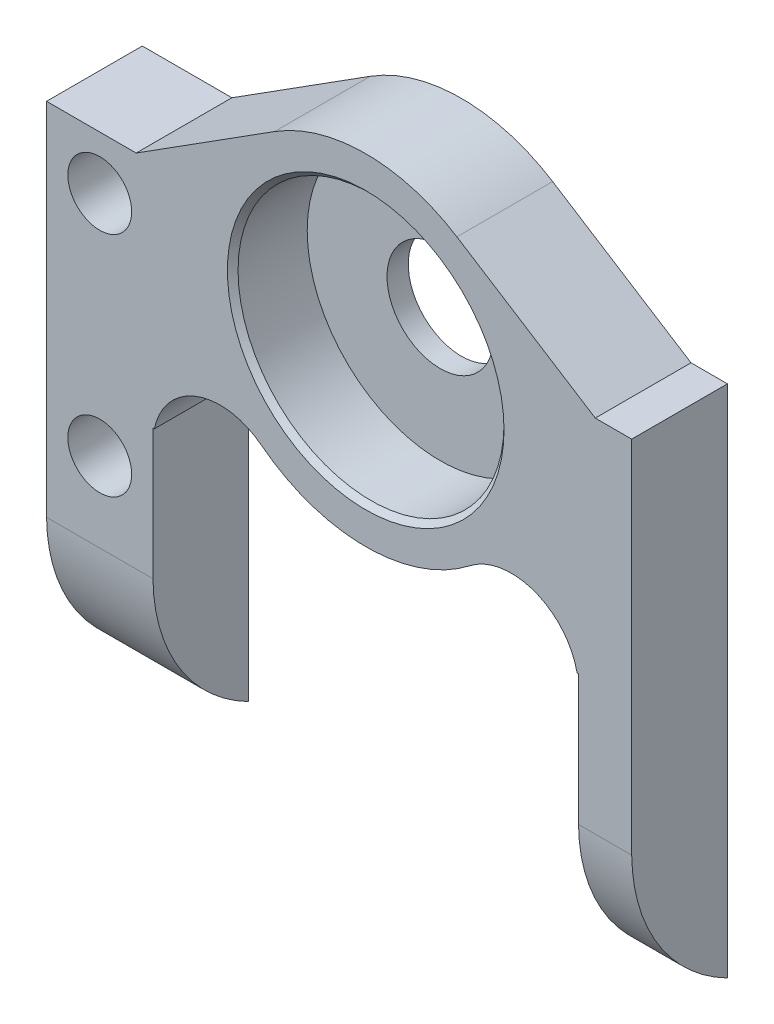
ISO-10303-21;
HEADER;
FILE_DESCRIPTION(('STEP AP214'),'2;1');
FILE_NAME('part.step','',(''),(''),'','','');
FILE_SCHEMA(('AUTOMOTIVE_DESIGN { 1 0 10303 214 1 1 1 1 }'));
ENDSEC;
DATA;
#1=APPLICATION_CONTEXT('core data for automotive mechanical design processes');
#2=APPLICATION_PROTOCOL_DEFINITION('international standard','automotive_design',2000,#1);
#3=PRODUCT_CONTEXT('',#1,'mechanical');
#4=PRODUCT('Part','Part','',(#3));
#5=PRODUCT_RELATED_PRODUCT_CATEGORY('part','',(#4));
#6=PRODUCT_DEFINITION_FORMATION('','',#4);
#7=PRODUCT_DEFINITION_CONTEXT('part definition',#1,'design');
#8=PRODUCT_DEFINITION('design','',#6,#7);
#9=PRODUCT_DEFINITION_SHAPE('','',#8);
#10=(LENGTH_UNIT() NAMED_UNIT(*) SI_UNIT(.MILLI.,.METRE.));
#11=(NAMED_UNIT(*) PLANE_ANGLE_UNIT() SI_UNIT($,.RADIAN.));
#12=(NAMED_UNIT(*) SI_UNIT($,.STERADIAN.) SOLID_ANGLE_UNIT());
#13=UNCERTAINTY_MEASURE_WITH_UNIT(LENGTH_MEASURE(1.E-05),#10,'distance_accuracy_value','');
#14=(GEOMETRIC_REPRESENTATION_CONTEXT(3) GLOBAL_UNCERTAINTY_ASSIGNED_CONTEXT((#13)) GLOBAL_UNIT_ASSIGNED_CONTEXT((#10,
#11,#12)) REPRESENTATION_CONTEXT('',''));
#15=CARTESIAN_POINT('',(0.,0.,0.));
#16=DIRECTION('',(0.,0.,1.));
#17=DIRECTION('',(1.,0.,0.));
#18=AXIS2_PLACEMENT_3D('',#15,#16,#17);
#19=CARTESIAN_POINT('',(20.4539793715245,36.3079461033165,38.4919127822395));
#20=DIRECTION('',(0.,-1.,0.));
#21=DIRECTION('',(0.,0.,-1.));
#22=AXIS2_PLACEMENT_3D('',#19,#20,#21);
#23=PLANE('',#22);
#24=DIRECTION('',(-1.,0.,0.));
#25=VECTOR('',#24,1.);
#26=CARTESIAN_POINT('',(19.6660837446074,36.3079461033165,58.9779248072098));
#27=LINE('',#26,#25);
#28=CARTESIAN_POINT('',(18.9539793715244,36.3079461033165,58.9779248072098));
#29=VERTEX_POINT('',#28);
#30=CARTESIAN_POINT('',(17.2418749984415,36.3079461033165,58.9779248072098));
#31=VERTEX_POINT('',#30);
#32=EDGE_CURVE('E58',#29,#31,#27,.T.);
#33=ORIENTED_EDGE('',*,*,#32,.F.);
#34=DIRECTION('',(0.,0.,1.));
#35=VECTOR('',#34,1.);
#36=CARTESIAN_POINT('',(18.9539793715244,36.3079461033165,58.9779248072098));
#37=LINE('',#36,#35);
#38=CARTESIAN_POINT('',(18.9539793715244,36.3079461033165,54.4779248072098));
#39=VERTEX_POINT('',#38);
#40=EDGE_CURVE('E174',#39,#29,#37,.T.);
#41=ORIENTED_EDGE('',*,*,#40,.F.);
#42=DIRECTION('',(-1.,0.,0.));
#43=VECTOR('',#42,1.);
#44=CARTESIAN_POINT('',(20.4539793715245,36.3079461033165,54.4779248072098));
#45=LINE('',#44,#43);
#46=CARTESIAN_POINT('',(17.2418749984415,36.3079461033165,54.4779248072098));
#47=VERTEX_POINT('',#46);
#48=EDGE_CURVE('E205',#39,#47,#45,.T.);
#49=ORIENTED_EDGE('',*,*,#48,.T.);
#50=DIRECTION('',(0.,0.,1.));
#51=VECTOR('',#50,1.);
#52=CARTESIAN_POINT('',(17.2418749984415,36.3079461033164,48.713060951552));
#53=LINE('',#52,#51);
#54=EDGE_CURVE('E235',#47,#31,#53,.T.);
#55=ORIENTED_EDGE('',*,*,#54,.T.);
#56=EDGE_LOOP('',(#33,#41,#49,#55));
#57=FACE_BOUND('',#56,.T.);
#58=ADVANCED_FACE('F35',(#57),#23,.F.);
#59=CARTESIAN_POINT('',(16.4539793715245,26.9126796587266,47.2821640348694));
#60=DIRECTION('',(1.,0.,0.));
#61=DIRECTION('',(0.,1.,0.));
#62=AXIS2_PLACEMENT_3D('',#59,#60,#61);
#63=PLANE('',#62);
#64=DIRECTION('',(0.,1.,0.));
#65=VECTOR('',#64,1.);
#66=CARTESIAN_POINT('',(16.4539793715245,31.8046400649043,54.4779248072098));
#67=LINE('',#66,#65);
#68=CARTESIAN_POINT('',(16.4539793715245,12.1248421508215,54.4779248072098));
#69=VERTEX_POINT('',#68);
#70=CARTESIAN_POINT('',(16.4539793715245,25.509515316423,54.4779248072098));
#71=VERTEX_POINT('',#70);
#72=EDGE_CURVE('E212',#69,#71,#67,.T.);
#73=ORIENTED_EDGE('',*,*,#72,.F.);
#74=CARTESIAN_POINT('',(16.4539793715245,19.4736130832342,50.7285160827672));
#75=DIRECTION('',(1.,0.,0.));
#76=DIRECTION('',(0.,0.,-1.));
#77=AXIS2_PLACEMENT_3D('',#74,#75,#76);
#78=CIRCLE('',#77,8.25);
#79=CARTESIAN_POINT('',(16.4539793715245,19.3748421508215,58.9779248072098));
#80=VERTEX_POINT('',#79);
#81=EDGE_CURVE('E176',#69,#80,#78,.F.);
#82=ORIENTED_EDGE('',*,*,#81,.T.);
#83=DIRECTION('',(0.,1.,0.));
#84=VECTOR('',#83,1.);
#85=CARTESIAN_POINT('',(16.4539793715245,33.6779461033165,58.9779248072098));
#86=LINE('',#85,#84);
#87=CARTESIAN_POINT('',(16.4539793715245,25.509515316423,58.9779248072098));
#88=VERTEX_POINT('',#87);
#89=EDGE_CURVE('E168',#80,#88,#86,.T.);
#90=ORIENTED_EDGE('',*,*,#89,.T.);
#91=DIRECTION('',(0.,0.,1.));
#92=VECTOR('',#91,1.);
#93=CARTESIAN_POINT('',(16.4539793715245,25.509515316423,38.021715158118));
#94=LINE('',#93,#92);
#95=EDGE_CURVE('E209',#71,#88,#94,.T.);
#96=ORIENTED_EDGE('',*,*,#95,.F.);
#97=EDGE_LOOP('',(#73,#82,#90,#96));
#98=FACE_BOUND('',#97,.T.);
#99=ADVANCED_FACE('F330',(#98),#63,.F.);
#100=CARTESIAN_POINT('',(-3.54602062847552,26.9126796587266,47.2821640348694));
#101=DIRECTION('',(1.,0.,0.));
#102=DIRECTION('',(0.,1.,0.));
#103=AXIS2_PLACEMENT_3D('',#100,#101,#102);
#104=PLANE('',#103);
#105=CARTESIAN_POINT('',(-3.54602062847553,19.4736130832342,50.7285160827672));
#106=DIRECTION('',(1.,0.,0.));
#107=DIRECTION('',(0.,0.,-1.));
#108=AXIS2_PLACEMENT_3D('',#105,#106,#107);
#109=CIRCLE('',#108,8.25);
#110=CARTESIAN_POINT('',(-3.54602062847552,12.1248421508215,54.4779248072098));
#111=VERTEX_POINT('',#110);
#112=CARTESIAN_POINT('',(-3.54602062847551,19.3748421508215,58.9779248072098));
#113=VERTEX_POINT('',#112);
#114=EDGE_CURVE('E169',#111,#113,#109,.F.);
#115=ORIENTED_EDGE('',*,*,#114,.F.);
#116=DIRECTION('',(0.,-1.,0.));
#117=VECTOR('',#116,1.);
#118=CARTESIAN_POINT('',(-3.54602062847552,31.8046400649043,54.4779248072098));
#119=LINE('',#118,#117);
#120=CARTESIAN_POINT('',(-3.54602062847552,25.509515316423,54.4779248072098));
#121=VERTEX_POINT('',#120);
#122=EDGE_CURVE('E218',#121,#111,#119,.T.);
#123=ORIENTED_EDGE('',*,*,#122,.F.);
#124=DIRECTION('',(0.,0.,-1.));
#125=VECTOR('',#124,1.);
#126=CARTESIAN_POINT('',(-3.54602062847552,25.509515316423,38.021715158118));
#127=LINE('',#126,#125);
#128=CARTESIAN_POINT('',(-3.54602062847552,25.509515316423,58.9779248072098));
#129=VERTEX_POINT('',#128);
#130=EDGE_CURVE('E207',#129,#121,#127,.T.);
#131=ORIENTED_EDGE('',*,*,#130,.F.);
#132=DIRECTION('',(0.,-1.,0.));
#133=VECTOR('',#132,1.);
#134=CARTESIAN_POINT('',(-3.54602062847552,33.6779461033165,58.9779248072098));
#135=LINE('',#134,#133);
#136=EDGE_CURVE('E221',#129,#113,#135,.T.);
#137=ORIENTED_EDGE('',*,*,#136,.T.);
#138=EDGE_LOOP('',(#115,#123,#131,#137));
#139=FACE_BOUND('',#138,.T.);
#140=ADVANCED_FACE('F37',(#139),#104,.T.);
#141=CARTESIAN_POINT('',(6.45397937152447,31.8046400649043,54.4779248072098));
#142=DIRECTION('',(0.,0.,1.));
#143=DIRECTION('',(1.,0.,0.));
#144=AXIS2_PLACEMENT_3D('',#141,#142,#143);
#145=PLANE('',#144);
#146=CARTESIAN_POINT('',(-6.04602062847552,23.1248421508215,54.4779248072098));
#147=DIRECTION('',(0.,0.,1.));
#148=DIRECTION('',(1.,0.,0.));
#149=AXIS2_PLACEMENT_3D('',#146,#147,#148);
#150=CIRCLE('',#149,1.5);
#151=CARTESIAN_POINT('',(-4.54602062847552,23.1248421508215,54.4779248072098));
#152=VERTEX_POINT('',#151);
#153=EDGE_CURVE('E192',#152,#152,#150,.T.);
#154=ORIENTED_EDGE('',*,*,#153,.T.);
#155=EDGE_LOOP('',(#154));
#156=FACE_BOUND('',#155,.T.);
#157=CARTESIAN_POINT('',(-6.04602062847552,33.8079461033165,54.4779248072098));
#158=DIRECTION('',(0.,0.,1.));
#159=DIRECTION('',(1.,0.,0.));
#160=AXIS2_PLACEMENT_3D('',#157,#158,#159);
#161=CIRCLE('',#160,1.5);
#162=CARTESIAN_POINT('',(-4.54602062847552,33.8079461033165,54.4779248072098));
#163=VERTEX_POINT('',#162);
#164=EDGE_CURVE('E189',#163,#163,#161,.T.);
#165=ORIENTED_EDGE('',*,*,#164,.T.);
#166=EDGE_LOOP('',(#165));
#167=FACE_BOUND('',#166,.T.);
#168=ORIENTED_EDGE('',*,*,#48,.F.);
#169=DIRECTION('',(0.,1.,0.));
#170=VECTOR('',#169,1.);
#171=CARTESIAN_POINT('',(18.9539793715244,12.1248421508215,54.4779248072098));
#172=LINE('',#171,#170);
#173=CARTESIAN_POINT('',(18.9539793715244,12.1248421508215,54.4779248072098));
#174=VERTEX_POINT('',#173);
#175=EDGE_CURVE('E175',#174,#39,#172,.T.);
#176=ORIENTED_EDGE('',*,*,#175,.F.);
#177=DIRECTION('',(-1.,0.,0.));
#178=VECTOR('',#177,1.);
#179=CARTESIAN_POINT('',(40.4539793715245,12.1248421508215,54.4779248072098));
#180=LINE('',#179,#178);
#181=EDGE_CURVE('E156',#174,#69,#180,.T.);
#182=ORIENTED_EDGE('',*,*,#181,.T.);
#183=ORIENTED_EDGE('',*,*,#72,.T.);
#184=DIRECTION('',(-1.,0.,0.));
#185=VECTOR('',#184,1.);
#186=CARTESIAN_POINT('',(6.45397937152447,25.509515316423,54.4779248072098));
#187=LINE('',#186,#185);
#188=CARTESIAN_POINT('',(16.3879289501582,25.509515316423,54.4779248072098));
#189=VERTEX_POINT('',#188);
#190=EDGE_CURVE('E233',#71,#189,#187,.T.);
#191=ORIENTED_EDGE('',*,*,#190,.T.);
#192=CARTESIAN_POINT('',(13.2976004709454,24.8671776679955,54.4779248072098));
#193=DIRECTION('',(0.,0.,1.));
#194=DIRECTION('',(1.,0.,0.));
#195=AXIS2_PLACEMENT_3D('',#192,#193,#194);
#196=CIRCLE('',#195,3.15637890057911);
#197=CARTESIAN_POINT('',(11.3613963653006,27.3599354631535,54.4779248072098));
#198=VERTEX_POINT('',#197);
#199=EDGE_CURVE('E288',#189,#198,#196,.T.);
#200=ORIENTED_EDGE('',*,*,#199,.T.);
#201=CARTESIAN_POINT('',(6.45397937152447,33.6779461033165,54.4779248072098));
#202=DIRECTION('',(0.,0.,1.));
#203=DIRECTION('',(1.,0.,0.));
#204=AXIS2_PLACEMENT_3D('',#201,#202,#203);
#205=CIRCLE('',#204,8.);
#206=CARTESIAN_POINT('',(1.54656237811247,27.3599354628707,54.4779248072098));
#207=VERTEX_POINT('',#206);
#208=EDGE_CURVE('E270',#207,#198,#205,.T.);
#209=ORIENTED_EDGE('',*,*,#208,.F.);
#210=CARTESIAN_POINT('',(-0.389641727896427,24.8671776679955,54.4779248072098));
#211=DIRECTION('',(0.,0.,-1.));
#212=DIRECTION('',(1.,0.,0.));
#213=AXIS2_PLACEMENT_3D('',#210,#211,#212);
#214=CIRCLE('',#213,3.15637890057911);
#215=CARTESIAN_POINT('',(-3.47997020710922,25.509515316423,54.4779248072098));
#216=VERTEX_POINT('',#215);
#217=EDGE_CURVE('E269',#216,#207,#214,.T.);
#218=ORIENTED_EDGE('',*,*,#217,.F.);
#219=EDGE_CURVE('E226',#216,#121,#187,.T.);
#220=ORIENTED_EDGE('',*,*,#219,.T.);
#221=ORIENTED_EDGE('',*,*,#122,.T.);
#222=CARTESIAN_POINT('',(-8.54602062847552,12.1248421508215,54.4779248072098));
#223=VERTEX_POINT('',#222);
#224=EDGE_CURVE('E204',#111,#223,#180,.T.);
#225=ORIENTED_EDGE('',*,*,#224,.T.);
#226=DIRECTION('',(0.,-1.,0.));
#227=VECTOR('',#226,1.);
#228=CARTESIAN_POINT('',(-8.54602062847552,36.3079461033165,54.4779248072098));
#229=LINE('',#228,#227);
#230=CARTESIAN_POINT('',(-8.54602062847552,36.3079461033165,54.4779248072098));
#231=VERTEX_POINT('',#230);
#232=EDGE_CURVE('E198',#231,#223,#229,.T.);
#233=ORIENTED_EDGE('',*,*,#232,.F.);
#234=CARTESIAN_POINT('',(-4.33391625539253,36.3079461033165,54.4779248072098));
#235=VERTEX_POINT('',#234);
#236=EDGE_CURVE('E208',#235,#231,#45,.T.);
#237=ORIENTED_EDGE('',*,*,#236,.F.);
#238=DIRECTION('',(0.844399315538349,0.535714285714286,0.));
#239=VECTOR('',#238,1.);
#240=CARTESIAN_POINT('',(1.32086240547314,39.8955209099667,54.4779248072098));
#241=LINE('',#240,#239);
#242=CARTESIAN_POINT('',(2.16826508581018,40.4331406276233,54.4779248072098));
#243=VERTEX_POINT('',#242);
#244=EDGE_CURVE('E286',#235,#243,#241,.T.);
#245=ORIENTED_EDGE('',*,*,#244,.T.);
#246=CARTESIAN_POINT('',(6.45397937152447,33.6779461033165,54.4779248072098));
#247=DIRECTION('',(0.,0.,1.));
#248=DIRECTION('',(1.,0.,0.));
#249=AXIS2_PLACEMENT_3D('',#246,#247,#248);
#250=CIRCLE('',#249,8.);
#251=CARTESIAN_POINT('',(10.7396936572388,40.4331406276233,54.4779248072098));
#252=VERTEX_POINT('',#251);
#253=EDGE_CURVE('E258',#252,#243,#250,.T.);
#254=ORIENTED_EDGE('',*,*,#253,.F.);
#255=DIRECTION('',(-0.844399315538349,0.535714285714286,0.));
#256=VECTOR('',#255,1.);
#257=CARTESIAN_POINT('',(11.5870963375758,39.8955209099667,54.4779248072098));
#258=LINE('',#257,#256);
#259=EDGE_CURVE('E273',#47,#252,#258,.T.);
#260=ORIENTED_EDGE('',*,*,#259,.F.);
#261=EDGE_LOOP('',(#168,#176,#182,#183,#191,#200,#209,#218,#220,#221,#225,#233,#237,#245,#254,#260));
#262=FACE_BOUND('',#261,.T.);
#263=CARTESIAN_POINT('',(6.45397937152447,33.6779461033165,54.4779248072098));
#264=DIRECTION('',(0.,0.,1.));
#265=DIRECTION('',(1.,0.,0.));
#266=AXIS2_PLACEMENT_3D('',#263,#264,#265);
#267=CIRCLE('',#266,2.5);
#268=CARTESIAN_POINT('',(8.95397937152447,33.6779461033165,54.4779248072098));
#269=VERTEX_POINT('',#268);
#270=EDGE_CURVE('E278',#269,#269,#267,.T.);
#271=ORIENTED_EDGE('',*,*,#270,.T.);
#272=EDGE_LOOP('',(#271));
#273=FACE_BOUND('',#272,.T.);
#274=ADVANCED_FACE('F324',(#156,#167,#262,#273),#145,.F.);
#275=DIRECTION('',(0.,0.,1.));
#276=VECTOR('',#275,1.);
#277=CARTESIAN_POINT('',(-4.33391625539253,36.3079461033165,48.713060951552));
#278=LINE('',#277,#276);
#279=CARTESIAN_POINT('',(-4.33391625539253,36.3079461033165,58.9779248072098));
#280=VERTEX_POINT('',#279);
#281=EDGE_CURVE('E241',#235,#280,#278,.T.);
#282=ORIENTED_EDGE('',*,*,#281,.F.);
#283=ORIENTED_EDGE('',*,*,#236,.T.);
#284=DIRECTION('',(0.,0.,-1.));
#285=VECTOR('',#284,1.);
#286=CARTESIAN_POINT('',(-8.54602062847552,36.3079461033165,58.9779248072098));
#287=LINE('',#286,#285);
#288=CARTESIAN_POINT('',(-8.54602062847552,36.3079461033165,58.9779248072098));
#289=VERTEX_POINT('',#288);
#290=EDGE_CURVE('E195',#289,#231,#287,.T.);
#291=ORIENTED_EDGE('',*,*,#290,.F.);
#292=DIRECTION('',(-1.,0.,0.));
#293=VECTOR('',#292,1.);
#294=CARTESIAN_POINT('',(-4.33391625539253,36.3079461033165,58.9779248072098));
#295=LINE('',#294,#293);
#296=EDGE_CURVE('E238',#280,#289,#295,.T.);
#297=ORIENTED_EDGE('',*,*,#296,.F.);
#298=EDGE_LOOP('',(#282,#283,#291,#297));
#299=FACE_BOUND('',#298,.T.);
#300=ADVANCED_FACE('F314',(#299),#23,.F.);
#301=CARTESIAN_POINT('',(6.45397937152447,33.6779461033165,58.4779248072098));
#302=DIRECTION('',(0.,0.,1.));
#303=DIRECTION('',(1.,0.,0.));
#304=AXIS2_PLACEMENT_3D('',#301,#302,#303);
#305=CONICAL_SURFACE('',#304,6.,0.785398163397448);
#306=CARTESIAN_POINT('',(6.45397937152447,33.6779461033165,58.9779248072098));
#307=DIRECTION('',(0.,0.,-1.));
#308=DIRECTION('',(1.,0.,0.));
#309=AXIS2_PLACEMENT_3D('',#306,#307,#308);
#310=CIRCLE('',#309,6.5);
#311=CARTESIAN_POINT('',(12.9539793715245,33.6779461033165,58.9779248072098));
#312=VERTEX_POINT('',#311);
#313=EDGE_CURVE('E43',#312,#312,#310,.T.);
#314=ORIENTED_EDGE('',*,*,#313,.F.);
#315=EDGE_LOOP('',(#314));
#316=FACE_BOUND('',#315,.T.);
#317=CARTESIAN_POINT('',(6.45397937152447,33.6779461033165,58.7279248072098));
#318=DIRECTION('',(0.,0.,1.));
#319=DIRECTION('',(1.,0.,0.));
#320=AXIS2_PLACEMENT_3D('',#317,#318,#319);
#321=CIRCLE('',#320,6.25);
#322=CARTESIAN_POINT('',(12.7039793715245,33.6779461033165,58.7279248072098));
#323=VERTEX_POINT('',#322);
#324=EDGE_CURVE('E257',#323,#323,#321,.T.);
#325=ORIENTED_EDGE('',*,*,#324,.F.);
#326=EDGE_LOOP('',(#325));
#327=FACE_BOUND('',#326,.T.);
#328=ADVANCED_FACE('F312',(#316,#327),#305,.F.);
#329=CARTESIAN_POINT('',(20.4539793715245,33.6779461033165,58.9779248072098));
#330=DIRECTION('',(0.,0.,1.));
#331=DIRECTION('',(1.,0.,0.));
#332=AXIS2_PLACEMENT_3D('',#329,#330,#331);
#333=PLANE('',#332);
#334=DIRECTION('',(-1.,0.,0.));
#335=VECTOR('',#334,1.);
#336=CARTESIAN_POINT('',(18.9539793715244,19.3748421508215,58.9779248072098));
#337=LINE('',#336,#335);
#338=CARTESIAN_POINT('',(18.9539793715244,19.3748421508215,58.9779248072098));
#339=VERTEX_POINT('',#338);
#340=EDGE_CURVE('E153',#339,#80,#337,.T.);
#341=ORIENTED_EDGE('',*,*,#340,.F.);
#342=DIRECTION('',(0.,-1.,0.));
#343=VECTOR('',#342,1.);
#344=CARTESIAN_POINT('',(18.9539793715244,12.1248421508215,58.9779248072098));
#345=LINE('',#344,#343);
#346=EDGE_CURVE('E166',#29,#339,#345,.T.);
#347=ORIENTED_EDGE('',*,*,#346,.F.);
#348=ORIENTED_EDGE('',*,*,#32,.T.);
#349=DIRECTION('',(-0.844399315538349,0.535714285714286,0.));
#350=VECTOR('',#349,1.);
#351=CARTESIAN_POINT('',(20.7218365143816,34.1001457610857,58.9779248072098));
#352=LINE('',#351,#350);
#353=CARTESIAN_POINT('',(10.7396936572388,40.4331406276233,58.9779248072098));
#354=VERTEX_POINT('',#353);
#355=EDGE_CURVE('E263',#31,#354,#352,.T.);
#356=ORIENTED_EDGE('',*,*,#355,.T.);
#357=CARTESIAN_POINT('',(6.45397937152447,33.6779461033165,58.9779248072098));
#358=DIRECTION('',(0.,0.,1.));
#359=DIRECTION('',(1.,0.,0.));
#360=AXIS2_PLACEMENT_3D('',#357,#358,#359);
#361=CIRCLE('',#360,8.);
#362=CARTESIAN_POINT('',(2.16826508581018,40.4331406276233,58.9779248072098));
#363=VERTEX_POINT('',#362);
#364=EDGE_CURVE('E265',#354,#363,#361,.T.);
#365=ORIENTED_EDGE('',*,*,#364,.T.);
#366=DIRECTION('',(0.844399315538349,0.535714285714286,0.));
#367=VECTOR('',#366,1.);
#368=CARTESIAN_POINT('',(12.150407942953,46.7661354941609,58.9779248072098));
#369=LINE('',#368,#367);
#370=EDGE_CURVE('E283',#280,#363,#369,.T.);
#371=ORIENTED_EDGE('',*,*,#370,.F.);
#372=ORIENTED_EDGE('',*,*,#296,.T.);
#373=DIRECTION('',(0.,1.,0.));
#374=VECTOR('',#373,1.);
#375=CARTESIAN_POINT('',(-8.54602062847552,12.1248421508215,58.9779248072098));
#376=LINE('',#375,#374);
#377=CARTESIAN_POINT('',(-8.54602062847552,19.3748421508215,58.9779248072098));
#378=VERTEX_POINT('',#377);
#379=EDGE_CURVE('E201',#378,#289,#376,.T.);
#380=ORIENTED_EDGE('',*,*,#379,.F.);
#381=EDGE_CURVE('E50',#113,#378,#337,.T.);
#382=ORIENTED_EDGE('',*,*,#381,.F.);
#383=ORIENTED_EDGE('',*,*,#136,.F.);
#384=DIRECTION('',(-1.,0.,0.));
#385=VECTOR('',#384,1.);
#386=CARTESIAN_POINT('',(20.4539793715245,25.509515316423,58.9779248072098));
#387=LINE('',#386,#385);
#388=CARTESIAN_POINT('',(-3.47997020710922,25.509515316423,58.9779248072098));
#389=VERTEX_POINT('',#388);
#390=EDGE_CURVE('E224',#389,#129,#387,.T.);
#391=ORIENTED_EDGE('',*,*,#390,.F.);
#392=CARTESIAN_POINT('',(-0.389641727896427,24.8671776679955,58.9779248072098));
#393=DIRECTION('',(0.,0.,-1.));
#394=DIRECTION('',(1.,0.,0.));
#395=AXIS2_PLACEMENT_3D('',#392,#393,#394);
#396=CIRCLE('',#395,3.15637890057911);
#397=CARTESIAN_POINT('',(1.54656548003991,27.359933053499,58.9779248072098));
#398=VERTEX_POINT('',#397);
#399=EDGE_CURVE('E277',#389,#398,#396,.T.);
#400=ORIENTED_EDGE('',*,*,#399,.T.);
#401=CARTESIAN_POINT('',(6.45397937152447,33.6779461033165,58.9779248072098));
#402=DIRECTION('',(0.,0.,1.));
#403=DIRECTION('',(1.,0.,0.));
#404=AXIS2_PLACEMENT_3D('',#401,#402,#403);
#405=CIRCLE('',#404,8.);
#406=CARTESIAN_POINT('',(11.361393263009,27.359933053499,58.9779248072098));
#407=VERTEX_POINT('',#406);
#408=EDGE_CURVE('E274',#398,#407,#405,.T.);
#409=ORIENTED_EDGE('',*,*,#408,.T.);
#410=CARTESIAN_POINT('',(13.2976004709454,24.8671776679955,58.9779248072098));
#411=DIRECTION('',(0.,0.,1.));
#412=DIRECTION('',(1.,0.,0.));
#413=AXIS2_PLACEMENT_3D('',#410,#411,#412);
#414=CIRCLE('',#413,3.15637890057911);
#415=CARTESIAN_POINT('',(16.3879289501582,25.509515316423,58.9779248072098));
#416=VERTEX_POINT('',#415);
#417=EDGE_CURVE('E280',#416,#407,#414,.T.);
#418=ORIENTED_EDGE('',*,*,#417,.F.);
#419=EDGE_CURVE('E231',#88,#416,#387,.T.);
#420=ORIENTED_EDGE('',*,*,#419,.F.);
#421=ORIENTED_EDGE('',*,*,#89,.F.);
#422=EDGE_LOOP('',(#341,#347,#348,#356,#365,#371,#372,#380,#382,#383,#391,#400,#409,#418,#420,#421));
#423=FACE_BOUND('',#422,.T.);
#424=CARTESIAN_POINT('',(-6.04602062847552,23.1248421508215,58.9779248072098));
#425=DIRECTION('',(0.,0.,1.));
#426=DIRECTION('',(1.,0.,0.));
#427=AXIS2_PLACEMENT_3D('',#424,#425,#426);
#428=CIRCLE('',#427,1.5);
#429=CARTESIAN_POINT('',(-4.54602062847552,23.1248421508215,58.9779248072098));
#430=VERTEX_POINT('',#429);
#431=EDGE_CURVE('E183',#430,#430,#428,.T.);
#432=ORIENTED_EDGE('',*,*,#431,.F.);
#433=EDGE_LOOP('',(#432));
#434=FACE_BOUND('',#433,.T.);
#435=CARTESIAN_POINT('',(-6.04602062847552,33.8079461033165,58.9779248072098));
#436=DIRECTION('',(0.,0.,1.));
#437=DIRECTION('',(1.,0.,0.));
#438=AXIS2_PLACEMENT_3D('',#435,#436,#437);
#439=CIRCLE('',#438,1.5);
#440=CARTESIAN_POINT('',(-4.54602062847552,33.8079461033165,58.9779248072098));
#441=VERTEX_POINT('',#440);
#442=EDGE_CURVE('E186',#441,#441,#439,.T.);
#443=ORIENTED_EDGE('',*,*,#442,.F.);
#444=EDGE_LOOP('',(#443));
#445=FACE_BOUND('',#444,.T.);
#446=ORIENTED_EDGE('',*,*,#313,.T.);
#447=EDGE_LOOP('',(#446));
#448=FACE_BOUND('',#447,.T.);
#449=ADVANCED_FACE('F164',(#423,#434,#445,#448),#333,.T.);
#450=CARTESIAN_POINT('',(13.2976004709454,24.8671776679955,54.4779248072098));
#451=DIRECTION('',(0.,0.,1.));
#452=DIRECTION('',(1.,0.,0.));
#453=AXIS2_PLACEMENT_3D('',#450,#451,#452);
#454=CYLINDRICAL_SURFACE('',#453,3.15637890057911);
#455=ORIENTED_EDGE('',*,*,#199,.F.);
#456=DIRECTION('',(0.,0.,1.));
#457=VECTOR('',#456,1.);
#458=CARTESIAN_POINT('',(16.3879289501582,25.509515316423,54.4779248072098));
#459=LINE('',#458,#457);
#460=EDGE_CURVE('E244',#189,#416,#459,.T.);
#461=ORIENTED_EDGE('',*,*,#460,.T.);
#462=ORIENTED_EDGE('',*,*,#417,.T.);
#463=DIRECTION('',(0.,0.,1.));
#464=VECTOR('',#463,1.);
#465=CARTESIAN_POINT('',(11.361393263009,27.359933053499,56.4779248072099));
#466=LINE('',#465,#464);
#467=EDGE_CURVE('E289',#198,#407,#466,.T.);
#468=ORIENTED_EDGE('',*,*,#467,.F.);
#469=EDGE_LOOP('',(#455,#461,#462,#468));
#470=FACE_BOUND('',#469,.T.);
#471=ADVANCED_FACE('F321',(#470),#454,.F.);
#472=CARTESIAN_POINT('',(14.5700508000959,38.0030379462775,54.4779248072098));
#473=DIRECTION('',(0.535714285714286,0.844399315538349,0.));
#474=DIRECTION('',(0.,0.,-1.));
#475=AXIS2_PLACEMENT_3D('',#472,#473,#474);
#476=PLANE('',#475);
#477=ORIENTED_EDGE('',*,*,#54,.F.);
#478=ORIENTED_EDGE('',*,*,#259,.T.);
#479=DIRECTION('',(0.,0.,1.));
#480=VECTOR('',#479,1.);
#481=CARTESIAN_POINT('',(10.7396936572388,40.4331406276233,54.4779248072098));
#482=LINE('',#481,#480);
#483=EDGE_CURVE('E261',#252,#354,#482,.T.);
#484=ORIENTED_EDGE('',*,*,#483,.T.);
#485=ORIENTED_EDGE('',*,*,#355,.F.);
#486=EDGE_LOOP('',(#477,#478,#484,#485));
#487=FACE_BOUND('',#486,.T.);
#488=ADVANCED_FACE('F346',(#487),#476,.T.);
#489=CARTESIAN_POINT('',(6.45397937152447,33.6779461033165,54.4779248072098));
#490=DIRECTION('',(0.,0.,1.));
#491=DIRECTION('',(1.,0.,0.));
#492=AXIS2_PLACEMENT_3D('',#489,#490,#491);
#493=CYLINDRICAL_SURFACE('',#492,8.);
#494=ORIENTED_EDGE('',*,*,#364,.F.);
#495=ORIENTED_EDGE('',*,*,#483,.F.);
#496=ORIENTED_EDGE('',*,*,#253,.T.);
#497=DIRECTION('',(0.,0.,1.));
#498=VECTOR('',#497,1.);
#499=CARTESIAN_POINT('',(2.16826508581018,40.4331406276233,54.4779248072098));
#500=LINE('',#499,#498);
#501=EDGE_CURVE('E262',#243,#363,#500,.T.);
#502=ORIENTED_EDGE('',*,*,#501,.T.);
#503=EDGE_LOOP('',(#494,#495,#496,#502));
#504=FACE_BOUND('',#503,.T.);
#505=ADVANCED_FACE('F343',(#504),#493,.T.);
#506=CARTESIAN_POINT('',(-1.66209205704696,38.0030379462775,54.4779248072098));
#507=DIRECTION('',(0.535714285714286,-0.844399315538349,0.));
#508=DIRECTION('',(0.,0.,-1.));
#509=AXIS2_PLACEMENT_3D('',#506,#507,#508);
#510=PLANE('',#509);
#511=ORIENTED_EDGE('',*,*,#244,.F.);
#512=ORIENTED_EDGE('',*,*,#281,.T.);
#513=ORIENTED_EDGE('',*,*,#370,.T.);
#514=ORIENTED_EDGE('',*,*,#501,.F.);
#515=EDGE_LOOP('',(#511,#512,#513,#514));
#516=FACE_BOUND('',#515,.T.);
#517=ADVANCED_FACE('F339',(#516),#510,.F.);
#518=CARTESIAN_POINT('',(-0.389641727896427,24.8671776679955,54.4779248072098));
#519=DIRECTION('',(0.,0.,1.));
#520=DIRECTION('',(1.,0.,0.));
#521=AXIS2_PLACEMENT_3D('',#518,#519,#520);
#522=CYLINDRICAL_SURFACE('',#521,3.15637890057911);
#523=ORIENTED_EDGE('',*,*,#399,.F.);
#524=DIRECTION('',(0.,0.,1.));
#525=VECTOR('',#524,1.);
#526=CARTESIAN_POINT('',(-3.47997020710922,25.509515316423,54.4779248072098));
#527=LINE('',#526,#525);
#528=EDGE_CURVE('E247',#389,#216,#527,.F.);
#529=ORIENTED_EDGE('',*,*,#528,.T.);
#530=ORIENTED_EDGE('',*,*,#217,.T.);
#531=DIRECTION('',(0.,0.,1.));
#532=VECTOR('',#531,1.);
#533=CARTESIAN_POINT('',(1.54656548003991,27.359933053499,56.4779248072099));
#534=LINE('',#533,#532);
#535=EDGE_CURVE('E266',#207,#398,#534,.T.);
#536=ORIENTED_EDGE('',*,*,#535,.T.);
#537=EDGE_LOOP('',(#523,#529,#530,#536));
#538=FACE_BOUND('',#537,.T.);
#539=ADVANCED_FACE('F342',(#538),#522,.F.);
#540=CARTESIAN_POINT('',(6.45397937152447,33.6779461033165,54.4779248072098));
#541=DIRECTION('',(0.,0.,1.));
#542=DIRECTION('',(1.,0.,0.));
#543=AXIS2_PLACEMENT_3D('',#540,#541,#542);
#544=CYLINDRICAL_SURFACE('',#543,8.);
#545=ORIENTED_EDGE('',*,*,#408,.F.);
#546=ORIENTED_EDGE('',*,*,#535,.F.);
#547=ORIENTED_EDGE('',*,*,#208,.T.);
#548=ORIENTED_EDGE('',*,*,#467,.T.);
#549=EDGE_LOOP('',(#545,#546,#547,#548));
#550=FACE_BOUND('',#549,.T.);
#551=ADVANCED_FACE('F348',(#550),#544,.T.);
#552=CARTESIAN_POINT('',(6.45397937152447,33.6779461033165,45.7779248072098));
#553=DIRECTION('',(0.,0.,1.));
#554=DIRECTION('',(1.,0.,0.));
#555=AXIS2_PLACEMENT_3D('',#552,#553,#554);
#556=CYLINDRICAL_SURFACE('',#555,2.5);
#557=ORIENTED_EDGE('',*,*,#270,.F.);
#558=EDGE_LOOP('',(#557));
#559=FACE_BOUND('',#558,.T.);
#560=CARTESIAN_POINT('',(6.45397937152447,33.6779461033165,55.4779248072099));
#561=DIRECTION('',(0.,0.,1.));
#562=DIRECTION('',(1.,0.,0.));
#563=AXIS2_PLACEMENT_3D('',#560,#561,#562);
#564=CIRCLE('',#563,2.5);
#565=CARTESIAN_POINT('',(8.95397937152447,33.6779461033165,55.4779248072099));
#566=VERTEX_POINT('',#565);
#567=EDGE_CURVE('E252',#566,#566,#564,.T.);
#568=ORIENTED_EDGE('',*,*,#567,.T.);
#569=EDGE_LOOP('',(#568));
#570=FACE_BOUND('',#569,.T.);
#571=ADVANCED_FACE('F350',(#559,#570),#556,.F.);
#572=CARTESIAN_POINT('',(6.45397937152447,33.6779461033165,65.2779248072099));
#573=DIRECTION('',(0.,0.,-1.));
#574=DIRECTION('',(-1.,0.,0.));
#575=AXIS2_PLACEMENT_3D('',#572,#573,#574);
#576=CYLINDRICAL_SURFACE('',#575,6.25);
#577=CARTESIAN_POINT('',(6.45397937152447,33.6779461033165,55.4779248072099));
#578=DIRECTION('',(0.,0.,1.));
#579=DIRECTION('',(1.,0.,0.));
#580=AXIS2_PLACEMENT_3D('',#577,#578,#579);
#581=CIRCLE('',#580,6.25);
#582=CARTESIAN_POINT('',(12.7039793715245,33.6779461033165,55.4779248072099));
#583=VERTEX_POINT('',#582);
#584=EDGE_CURVE('E11',#583,#583,#581,.T.);
#585=ORIENTED_EDGE('',*,*,#584,.F.);
#586=EDGE_LOOP('',(#585));
#587=FACE_BOUND('',#586,.T.);
#588=ORIENTED_EDGE('',*,*,#324,.T.);
#589=EDGE_LOOP('',(#588));
#590=FACE_BOUND('',#589,.T.);
#591=ADVANCED_FACE('F310',(#587,#590),#576,.F.);
#592=CARTESIAN_POINT('',(6.45397937152447,33.6779461033165,55.4779248072099));
#593=DIRECTION('',(0.,0.,1.));
#594=DIRECTION('',(1.,0.,0.));
#595=AXIS2_PLACEMENT_3D('',#592,#593,#594);
#596=PLANE('',#595);
#597=ORIENTED_EDGE('',*,*,#584,.T.);
#598=EDGE_LOOP('',(#597));
#599=FACE_BOUND('',#598,.T.);
#600=ORIENTED_EDGE('',*,*,#567,.F.);
#601=EDGE_LOOP('',(#600));
#602=FACE_BOUND('',#601,.T.);
#603=ADVANCED_FACE('F410',(#599,#602),#596,.T.);
#604=CARTESIAN_POINT('',(-28.7897424955555,25.509515316423,50.8537295765763));
#605=DIRECTION('',(0.,1.,0.));
#606=DIRECTION('',(0.,0.,1.));
#607=AXIS2_PLACEMENT_3D('',#604,#605,#606);
#608=PLANE('',#607);
#609=ORIENTED_EDGE('',*,*,#95,.T.);
#610=ORIENTED_EDGE('',*,*,#419,.T.);
#611=ORIENTED_EDGE('',*,*,#460,.F.);
#612=ORIENTED_EDGE('',*,*,#190,.F.);
#613=EDGE_LOOP('',(#609,#610,#611,#612));
#614=FACE_BOUND('',#613,.T.);
#615=ADVANCED_FACE('F375',(#614),#608,.F.);
#616=ORIENTED_EDGE('',*,*,#528,.F.);
#617=ORIENTED_EDGE('',*,*,#390,.T.);
#618=ORIENTED_EDGE('',*,*,#130,.T.);
#619=ORIENTED_EDGE('',*,*,#219,.F.);
#620=EDGE_LOOP('',(#616,#617,#618,#619));
#621=FACE_BOUND('',#620,.T.);
#622=ADVANCED_FACE('F400',(#621),#608,.F.);
#623=CARTESIAN_POINT('',(-8.54602062847552,0.,0.));
#624=DIRECTION('',(-1.,0.,0.));
#625=DIRECTION('',(0.,0.,1.));
#626=AXIS2_PLACEMENT_3D('',#623,#624,#625);
#627=PLANE('',#626);
#628=CARTESIAN_POINT('',(-8.54602062847552,19.4736130832342,50.7285160827672));
#629=DIRECTION('',(1.,0.,0.));
#630=DIRECTION('',(0.,0.,-1.));
#631=AXIS2_PLACEMENT_3D('',#628,#629,#630);
#632=CIRCLE('',#631,8.25);
#633=EDGE_CURVE('E161',#378,#223,#632,.T.);
#634=ORIENTED_EDGE('',*,*,#633,.F.);
#635=ORIENTED_EDGE('',*,*,#379,.T.);
#636=ORIENTED_EDGE('',*,*,#290,.T.);
#637=ORIENTED_EDGE('',*,*,#232,.T.);
#638=EDGE_LOOP('',(#634,#635,#636,#637));
#639=FACE_BOUND('',#638,.T.);
#640=ADVANCED_FACE('F392',(#639),#627,.T.);
#641=CARTESIAN_POINT('',(-6.04602062847552,33.8079461033165,54.4778998072098));
#642=DIRECTION('',(0.,0.,1.));
#643=DIRECTION('',(1.,0.,0.));
#644=AXIS2_PLACEMENT_3D('',#641,#642,#643);
#645=CYLINDRICAL_SURFACE('',#644,1.5);
#646=ORIENTED_EDGE('',*,*,#442,.T.);
#647=EDGE_LOOP('',(#646));
#648=FACE_BOUND('',#647,.T.);
#649=ORIENTED_EDGE('',*,*,#164,.F.);
#650=EDGE_LOOP('',(#649));
#651=FACE_BOUND('',#650,.T.);
#652=ADVANCED_FACE('F408',(#648,#651),#645,.F.);
#653=CARTESIAN_POINT('',(-6.04602062847552,23.1248421508215,54.4778998072098));
#654=DIRECTION('',(0.,0.,1.));
#655=DIRECTION('',(1.,0.,0.));
#656=AXIS2_PLACEMENT_3D('',#653,#654,#655);
#657=CYLINDRICAL_SURFACE('',#656,1.5);
#658=ORIENTED_EDGE('',*,*,#431,.T.);
#659=EDGE_LOOP('',(#658));
#660=FACE_BOUND('',#659,.T.);
#661=ORIENTED_EDGE('',*,*,#153,.F.);
#662=EDGE_LOOP('',(#661));
#663=FACE_BOUND('',#662,.T.);
#664=ADVANCED_FACE('F434',(#660,#663),#657,.F.);
#665=CARTESIAN_POINT('',(18.9539793715244,0.,0.));
#666=DIRECTION('',(-1.,0.,0.));
#667=DIRECTION('',(0.,0.,1.));
#668=AXIS2_PLACEMENT_3D('',#665,#666,#667);
#669=PLANE('',#668);
#670=ORIENTED_EDGE('',*,*,#346,.T.);
#671=CARTESIAN_POINT('',(18.9539793715244,19.4736130832342,50.7285160827672));
#672=DIRECTION('',(1.,0.,0.));
#673=DIRECTION('',(0.,0.,-1.));
#674=AXIS2_PLACEMENT_3D('',#671,#672,#673);
#675=CIRCLE('',#674,8.25);
#676=EDGE_CURVE('E150',#339,#174,#675,.T.);
#677=ORIENTED_EDGE('',*,*,#676,.T.);
#678=ORIENTED_EDGE('',*,*,#175,.T.);
#679=ORIENTED_EDGE('',*,*,#40,.T.);
#680=EDGE_LOOP('',(#670,#677,#678,#679));
#681=FACE_BOUND('',#680,.T.);
#682=ADVANCED_FACE('F172',(#681),#669,.F.);
#683=CARTESIAN_POINT('',(18.9539793715244,19.4736130832342,50.7285160827672));
#684=DIRECTION('',(-1.,0.,0.));
#685=DIRECTION('',(0.,0.,1.));
#686=AXIS2_PLACEMENT_3D('',#683,#684,#685);
#687=CYLINDRICAL_SURFACE('',#686,8.25);
#688=ORIENTED_EDGE('',*,*,#181,.F.);
#689=ORIENTED_EDGE('',*,*,#676,.F.);
#690=ORIENTED_EDGE('',*,*,#340,.T.);
#691=ORIENTED_EDGE('',*,*,#81,.F.);
#692=EDGE_LOOP('',(#688,#689,#690,#691));
#693=FACE_BOUND('',#692,.T.);
#694=ADVANCED_FACE('F152',(#693),#687,.T.);
#695=ORIENTED_EDGE('',*,*,#114,.T.);
#696=ORIENTED_EDGE('',*,*,#381,.T.);
#697=ORIENTED_EDGE('',*,*,#633,.T.);
#698=ORIENTED_EDGE('',*,*,#224,.F.);
#699=EDGE_LOOP('',(#695,#696,#697,#698));
#700=FACE_BOUND('',#699,.T.);
#701=ADVANCED_FACE('F396',(#700),#687,.T.);
#702=CLOSED_SHELL('',(#58,#99,#140,#274,#300,#328,#449,#471,#488,#505,#517,#539,#551,#571,#591,
#603,#615,#622,#640,#652,#664,#682,#694,#701));
#703=MANIFOLD_SOLID_BREP('B2',#702);
#704=ADVANCED_BREP_SHAPE_REPRESENTATION('',(#18,#703),#14);
#705=SHAPE_DEFINITION_REPRESENTATION(#9,#704);
ENDSEC;
END-ISO-10303-21;
